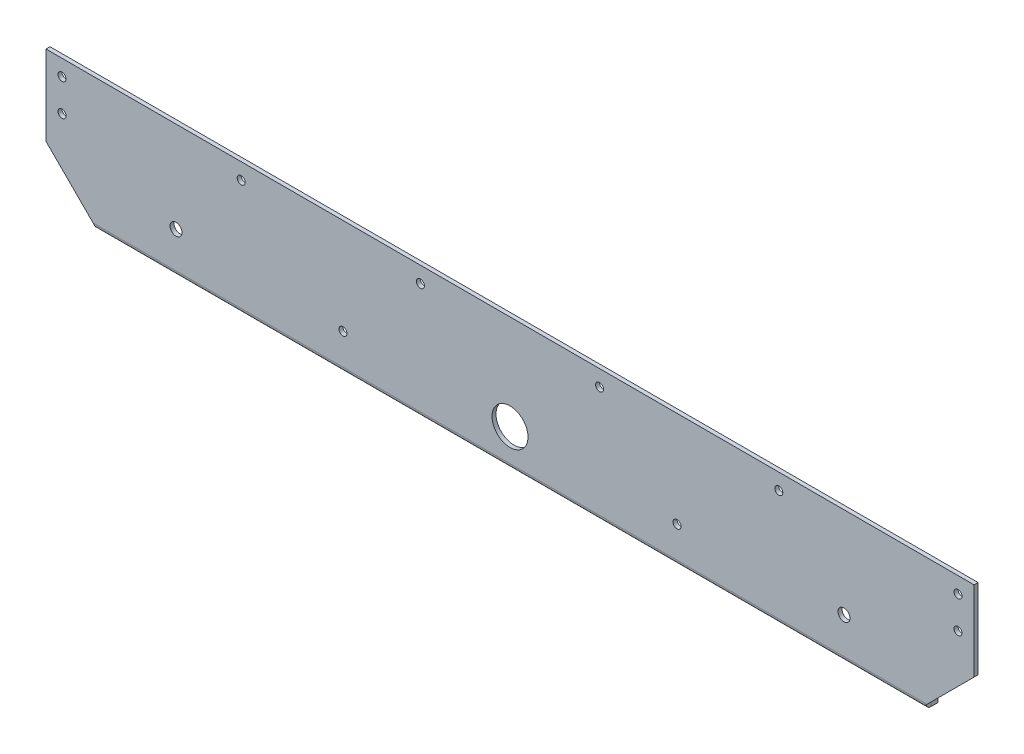
ISO-10303-21;
HEADER;
FILE_DESCRIPTION(('STEP AP214'),'2;1');
FILE_NAME('part.step','',(''),(''),'','','');
FILE_SCHEMA(('AUTOMOTIVE_DESIGN { 1 0 10303 214 1 1 1 1 }'));
ENDSEC;
DATA;
#1=APPLICATION_CONTEXT('core data for automotive mechanical design processes');
#2=APPLICATION_PROTOCOL_DEFINITION('international standard','automotive_design',2000,#1);
#3=PRODUCT_CONTEXT('',#1,'mechanical');
#4=PRODUCT('Part','Part','',(#3));
#5=PRODUCT_RELATED_PRODUCT_CATEGORY('part','',(#4));
#6=PRODUCT_DEFINITION_FORMATION('','',#4);
#7=PRODUCT_DEFINITION_CONTEXT('part definition',#1,'design');
#8=PRODUCT_DEFINITION('design','',#6,#7);
#9=PRODUCT_DEFINITION_SHAPE('','',#8);
#10=(LENGTH_UNIT() NAMED_UNIT(*) SI_UNIT(.MILLI.,.METRE.));
#11=(NAMED_UNIT(*) PLANE_ANGLE_UNIT() SI_UNIT($,.RADIAN.));
#12=(NAMED_UNIT(*) SI_UNIT($,.STERADIAN.) SOLID_ANGLE_UNIT());
#13=UNCERTAINTY_MEASURE_WITH_UNIT(LENGTH_MEASURE(1.E-05),#10,'distance_accuracy_value','');
#14=(GEOMETRIC_REPRESENTATION_CONTEXT(3) GLOBAL_UNCERTAINTY_ASSIGNED_CONTEXT((#13)) GLOBAL_UNIT_ASSIGNED_CONTEXT((#10,
#11,#12)) REPRESENTATION_CONTEXT('',''));
#15=CARTESIAN_POINT('',(0.,0.,0.));
#16=DIRECTION('',(0.,0.,1.));
#17=DIRECTION('',(1.,0.,0.));
#18=AXIS2_PLACEMENT_3D('',#15,#16,#17);
#19=CARTESIAN_POINT('',(-330.2,-50.8,-3.175));
#20=DIRECTION('',(1.,0.,0.));
#21=DIRECTION('',(0.,1.,0.));
#22=AXIS2_PLACEMENT_3D('',#19,#20,#21);
#23=PLANE('',#22);
#24=DIRECTION('',(0.,0.,1.));
#25=VECTOR('',#24,1.);
#26=CARTESIAN_POINT('',(-330.2,-50.8,-3.175));
#27=LINE('',#26,#25);
#28=CARTESIAN_POINT('',(-330.2,-50.8,-0.0699812005874288));
#29=VERTEX_POINT('',#28);
#30=CARTESIAN_POINT('',(-330.2,-50.8,0.));
#31=VERTEX_POINT('',#30);
#32=EDGE_CURVE('E54',#29,#31,#27,.T.);
#33=ORIENTED_EDGE('',*,*,#32,.F.);
#34=CARTESIAN_POINT('',(-330.2,-50.0634,-3.91159999999999));
#35=DIRECTION('',(-1.,0.,0.));
#36=DIRECTION('',(0.,0.,1.));
#37=AXIS2_PLACEMENT_3D('',#34,#35,#36);
#38=CIRCLE('',#37,3.9116);
#39=CARTESIAN_POINT('',(-330.2,-50.0634,0.));
#40=VERTEX_POINT('',#39);
#41=EDGE_CURVE('E11',#29,#40,#38,.T.);
#42=ORIENTED_EDGE('',*,*,#41,.T.);
#43=DIRECTION('',(0.,1.,0.));
#44=VECTOR('',#43,1.);
#45=CARTESIAN_POINT('',(-330.200000000004,-2.48843091726332E-11,0.));
#46=LINE('',#45,#44);
#47=EDGE_CURVE('E203',#31,#40,#46,.T.);
#48=ORIENTED_EDGE('',*,*,#47,.F.);
#49=EDGE_LOOP('',(#33,#42,#48));
#50=FACE_BOUND('',#49,.T.);
#51=ADVANCED_FACE('F37',(#50),#23,.T.);
#52=CARTESIAN_POINT('',(330.199999999999,-50.0634,-3.17499999999999));
#53=DIRECTION('',(-1.,-5.27529267742067E-13,0.));
#54=DIRECTION('',(5.27529267742067E-13,-1.,0.));
#55=AXIS2_PLACEMENT_3D('',#52,#53,#54);
#56=PLANE('',#55);
#57=DIRECTION('',(5.27529267742067E-13,-1.,0.));
#58=VECTOR('',#57,1.);
#59=CARTESIAN_POINT('',(330.199999999973,1.74190164208416E-10,0.));
#60=LINE('',#59,#58);
#61=CARTESIAN_POINT('',(330.199999999999,-50.0634,0.));
#62=VERTEX_POINT('',#61);
#63=CARTESIAN_POINT('',(330.2,-50.8,0.));
#64=VERTEX_POINT('',#63);
#65=EDGE_CURVE('E198',#62,#64,#60,.T.);
#66=ORIENTED_EDGE('',*,*,#65,.F.);
#67=CARTESIAN_POINT('',(330.199999999999,-50.0634,-3.91159999999999));
#68=DIRECTION('',(-1.,0.,0.));
#69=DIRECTION('',(0.,0.,1.));
#70=AXIS2_PLACEMENT_3D('',#67,#68,#69);
#71=CIRCLE('',#70,3.9116);
#72=CARTESIAN_POINT('',(330.199999999999,-50.8,-0.0699812005874288));
#73=VERTEX_POINT('',#72);
#74=EDGE_CURVE('E188',#62,#73,#71,.F.);
#75=ORIENTED_EDGE('',*,*,#74,.T.);
#76=DIRECTION('',(0.,0.,1.));
#77=VECTOR('',#76,1.);
#78=CARTESIAN_POINT('',(330.2,-50.8,-3.175));
#79=LINE('',#78,#77);
#80=EDGE_CURVE('E217',#73,#64,#79,.T.);
#81=ORIENTED_EDGE('',*,*,#80,.T.);
#82=EDGE_LOOP('',(#66,#75,#81));
#83=FACE_BOUND('',#82,.T.);
#84=ADVANCED_FACE('F269',(#83),#56,.T.);
#85=CARTESIAN_POINT('',(0.,0.,-3.175));
#86=DIRECTION('',(0.,0.,1.));
#87=DIRECTION('',(1.,0.,0.));
#88=AXIS2_PLACEMENT_3D('',#85,#86,#87);
#89=PLANE('',#88);
#90=CARTESIAN_POINT('',(132.584083532934,-25.4000000000025,-3.175));
#91=DIRECTION('',(0.,0.,1.));
#92=DIRECTION('',(1.,0.,0.));
#93=AXIS2_PLACEMENT_3D('',#90,#91,#92);
#94=CIRCLE('',#93,3.175);
#95=CARTESIAN_POINT('',(135.759083532934,-25.4000000000025,-3.175));
#96=VERTEX_POINT('',#95);
#97=EDGE_CURVE('E618',#96,#96,#94,.T.);
#98=ORIENTED_EDGE('',*,*,#97,.T.);
#99=EDGE_LOOP('',(#98));
#100=FACE_BOUND('',#99,.T.);
#101=CARTESIAN_POINT('',(-132.584083532934,-25.4,-3.175));
#102=DIRECTION('',(0.,0.,1.));
#103=DIRECTION('',(1.,0.,0.));
#104=AXIS2_PLACEMENT_3D('',#101,#102,#103);
#105=CIRCLE('',#104,3.175);
#106=CARTESIAN_POINT('',(-129.409083532934,-25.4,-3.175));
#107=VERTEX_POINT('',#106);
#108=EDGE_CURVE('E622',#107,#107,#105,.T.);
#109=ORIENTED_EDGE('',*,*,#108,.T.);
#110=EDGE_LOOP('',(#109));
#111=FACE_BOUND('',#110,.T.);
#112=CARTESIAN_POINT('',(213.36,38.1000000000001,-3.175));
#113=DIRECTION('',(0.,0.,1.));
#114=DIRECTION('',(1.,0.,0.));
#115=AXIS2_PLACEMENT_3D('',#112,#113,#114);
#116=CIRCLE('',#115,3.175);
#117=CARTESIAN_POINT('',(216.535,38.1000000000001,-3.175));
#118=VERTEX_POINT('',#117);
#119=EDGE_CURVE('E631',#118,#118,#116,.T.);
#120=ORIENTED_EDGE('',*,*,#119,.T.);
#121=EDGE_LOOP('',(#120));
#122=FACE_BOUND('',#121,.T.);
#123=CARTESIAN_POINT('',(71.12,38.1000000000001,-3.175));
#124=DIRECTION('',(0.,0.,1.));
#125=DIRECTION('',(1.,0.,0.));
#126=AXIS2_PLACEMENT_3D('',#123,#124,#125);
#127=CIRCLE('',#126,3.175);
#128=CARTESIAN_POINT('',(74.295,38.1000000000001,-3.175));
#129=VERTEX_POINT('',#128);
#130=EDGE_CURVE('E637',#129,#129,#127,.T.);
#131=ORIENTED_EDGE('',*,*,#130,.T.);
#132=EDGE_LOOP('',(#131));
#133=FACE_BOUND('',#132,.T.);
#134=CARTESIAN_POINT('',(-71.12,38.1000000000001,-3.175));
#135=DIRECTION('',(0.,0.,1.));
#136=DIRECTION('',(1.,0.,0.));
#137=AXIS2_PLACEMENT_3D('',#134,#135,#136);
#138=CIRCLE('',#137,3.175);
#139=CARTESIAN_POINT('',(-67.945,38.1000000000001,-3.175));
#140=VERTEX_POINT('',#139);
#141=EDGE_CURVE('E643',#140,#140,#138,.T.);
#142=ORIENTED_EDGE('',*,*,#141,.T.);
#143=EDGE_LOOP('',(#142));
#144=FACE_BOUND('',#143,.T.);
#145=CARTESIAN_POINT('',(-213.36,38.1000000000001,-3.175));
#146=DIRECTION('',(0.,0.,1.));
#147=DIRECTION('',(1.,0.,0.));
#148=AXIS2_PLACEMENT_3D('',#145,#146,#147);
#149=CIRCLE('',#148,3.175);
#150=CARTESIAN_POINT('',(-210.185,38.1000000000001,-3.175));
#151=VERTEX_POINT('',#150);
#152=EDGE_CURVE('E649',#151,#151,#149,.T.);
#153=ORIENTED_EDGE('',*,*,#152,.T.);
#154=EDGE_LOOP('',(#153));
#155=FACE_BOUND('',#154,.T.);
#156=CARTESIAN_POINT('',(-355.6,38.1,-3.175));
#157=DIRECTION('',(0.,0.,1.));
#158=DIRECTION('',(1.,0.,0.));
#159=AXIS2_PLACEMENT_3D('',#156,#157,#158);
#160=CIRCLE('',#159,3.17499999999997);
#161=CARTESIAN_POINT('',(-352.425,38.1,-3.175));
#162=VERTEX_POINT('',#161);
#163=EDGE_CURVE('E655',#162,#162,#160,.T.);
#164=ORIENTED_EDGE('',*,*,#163,.T.);
#165=EDGE_LOOP('',(#164));
#166=FACE_BOUND('',#165,.T.);
#167=CARTESIAN_POINT('',(-355.6,12.7,-3.175));
#168=DIRECTION('',(0.,0.,1.));
#169=DIRECTION('',(1.,0.,0.));
#170=AXIS2_PLACEMENT_3D('',#167,#168,#169);
#171=CIRCLE('',#170,3.17499999999997);
#172=CARTESIAN_POINT('',(-352.425,12.7,-3.175));
#173=VERTEX_POINT('',#172);
#174=EDGE_CURVE('E661',#173,#173,#171,.T.);
#175=ORIENTED_EDGE('',*,*,#174,.T.);
#176=EDGE_LOOP('',(#175));
#177=FACE_BOUND('',#176,.T.);
#178=CARTESIAN_POINT('',(355.6,12.7000000000001,-3.175));
#179=DIRECTION('',(0.,0.,1.));
#180=DIRECTION('',(1.,0.,0.));
#181=AXIS2_PLACEMENT_3D('',#178,#179,#180);
#182=CIRCLE('',#181,3.17499999999997);
#183=CARTESIAN_POINT('',(358.775,12.7000000000001,-3.175));
#184=VERTEX_POINT('',#183);
#185=EDGE_CURVE('E667',#184,#184,#182,.T.);
#186=ORIENTED_EDGE('',*,*,#185,.T.);
#187=EDGE_LOOP('',(#186));
#188=FACE_BOUND('',#187,.T.);
#189=CARTESIAN_POINT('',(355.6,38.1000000000001,-3.175));
#190=DIRECTION('',(0.,0.,1.));
#191=DIRECTION('',(1.,0.,0.));
#192=AXIS2_PLACEMENT_3D('',#189,#190,#191);
#193=CIRCLE('',#192,3.17499999999997);
#194=CARTESIAN_POINT('',(358.775,38.1000000000001,-3.175));
#195=VERTEX_POINT('',#194);
#196=EDGE_CURVE('E673',#195,#195,#193,.T.);
#197=ORIENTED_EDGE('',*,*,#196,.T.);
#198=EDGE_LOOP('',(#197));
#199=FACE_BOUND('',#198,.T.);
#200=CARTESIAN_POINT('',(265.1125,-21.4884,-3.175));
#201=DIRECTION('',(0.,0.,1.));
#202=DIRECTION('',(1.,0.,0.));
#203=AXIS2_PLACEMENT_3D('',#200,#201,#202);
#204=CIRCLE('',#203,4.76250000000001);
#205=CARTESIAN_POINT('',(269.875,-21.4884,-3.175));
#206=VERTEX_POINT('',#205);
#207=EDGE_CURVE('E679',#206,#206,#204,.T.);
#208=ORIENTED_EDGE('',*,*,#207,.T.);
#209=EDGE_LOOP('',(#208));
#210=FACE_BOUND('',#209,.T.);
#211=CARTESIAN_POINT('',(-265.1125,-21.4884,-3.175));
#212=DIRECTION('',(0.,0.,1.));
#213=DIRECTION('',(1.,0.,0.));
#214=AXIS2_PLACEMENT_3D('',#211,#212,#213);
#215=CIRCLE('',#214,4.76250000000001);
#216=CARTESIAN_POINT('',(-260.35,-21.4884,-3.175));
#217=VERTEX_POINT('',#216);
#218=EDGE_CURVE('E685',#217,#217,#215,.T.);
#219=ORIENTED_EDGE('',*,*,#218,.T.);
#220=EDGE_LOOP('',(#219));
#221=FACE_BOUND('',#220,.T.);
#222=CARTESIAN_POINT('',(0.,-24.6634,-3.175));
#223=DIRECTION('',(0.,0.,1.));
#224=DIRECTION('',(1.,0.,0.));
#225=AXIS2_PLACEMENT_3D('',#222,#223,#224);
#226=CIRCLE('',#225,14.2875);
#227=CARTESIAN_POINT('',(14.2875,-24.6634,-3.175));
#228=VERTEX_POINT('',#227);
#229=EDGE_CURVE('E691',#228,#228,#226,.T.);
#230=ORIENTED_EDGE('',*,*,#229,.T.);
#231=EDGE_LOOP('',(#230));
#232=FACE_BOUND('',#231,.T.);
#233=DIRECTION('',(0.,1.,0.));
#234=VECTOR('',#233,1.);
#235=CARTESIAN_POINT('',(-330.2,-50.8,-3.175));
#236=LINE('',#235,#234);
#237=CARTESIAN_POINT('',(-330.2,-50.8,-3.175));
#238=VERTEX_POINT('',#237);
#239=CARTESIAN_POINT('',(-330.2,-50.0634,-3.175));
#240=VERTEX_POINT('',#239);
#241=EDGE_CURVE('E196',#238,#240,#236,.T.);
#242=ORIENTED_EDGE('',*,*,#241,.F.);
#243=DIRECTION('',(-0.707106781186548,0.707106781186547,0.));
#244=VECTOR('',#243,1.);
#245=CARTESIAN_POINT('',(-330.2,-50.8,-3.175));
#246=LINE('',#245,#244);
#247=CARTESIAN_POINT('',(-368.3,-12.7,-3.175));
#248=VERTEX_POINT('',#247);
#249=EDGE_CURVE('E219',#238,#248,#246,.T.);
#250=ORIENTED_EDGE('',*,*,#249,.T.);
#251=DIRECTION('',(0.,-1.,0.));
#252=VECTOR('',#251,1.);
#253=CARTESIAN_POINT('',(-368.3,50.8,-3.175));
#254=LINE('',#253,#252);
#255=CARTESIAN_POINT('',(-368.3,50.8,-3.175));
#256=VERTEX_POINT('',#255);
#257=EDGE_CURVE('E235',#256,#248,#254,.T.);
#258=ORIENTED_EDGE('',*,*,#257,.F.);
#259=DIRECTION('',(-1.,0.,0.));
#260=VECTOR('',#259,1.);
#261=CARTESIAN_POINT('',(-368.3,50.8,-3.175));
#262=LINE('',#261,#260);
#263=CARTESIAN_POINT('',(368.3,50.8,-3.175));
#264=VERTEX_POINT('',#263);
#265=EDGE_CURVE('E231',#264,#256,#262,.T.);
#266=ORIENTED_EDGE('',*,*,#265,.F.);
#267=DIRECTION('',(0.,1.,0.));
#268=VECTOR('',#267,1.);
#269=CARTESIAN_POINT('',(368.3,50.8,-3.175));
#270=LINE('',#269,#268);
#271=CARTESIAN_POINT('',(368.3,-12.7,-3.175));
#272=VERTEX_POINT('',#271);
#273=EDGE_CURVE('E229',#272,#264,#270,.T.);
#274=ORIENTED_EDGE('',*,*,#273,.F.);
#275=DIRECTION('',(-0.707106781186548,-0.707106781186547,0.));
#276=VECTOR('',#275,1.);
#277=CARTESIAN_POINT('',(330.2,-50.8,-3.175));
#278=LINE('',#277,#276);
#279=CARTESIAN_POINT('',(330.2,-50.8,-3.175));
#280=VERTEX_POINT('',#279);
#281=EDGE_CURVE('E207',#272,#280,#278,.T.);
#282=ORIENTED_EDGE('',*,*,#281,.T.);
#283=DIRECTION('',(5.27529267742067E-13,-1.,0.));
#284=VECTOR('',#283,1.);
#285=CARTESIAN_POINT('',(330.199999999999,-50.0634,-3.17499999999999));
#286=LINE('',#285,#284);
#287=CARTESIAN_POINT('',(330.199999999999,-50.0634,-3.175));
#288=VERTEX_POINT('',#287);
#289=EDGE_CURVE('E190',#288,#280,#286,.T.);
#290=ORIENTED_EDGE('',*,*,#289,.F.);
#291=DIRECTION('',(-1.,0.,0.));
#292=VECTOR('',#291,1.);
#293=CARTESIAN_POINT('',(-330.2,-50.0634,-3.17499999999999));
#294=LINE('',#293,#292);
#295=EDGE_CURVE('E62',#240,#288,#294,.F.);
#296=ORIENTED_EDGE('',*,*,#295,.F.);
#297=EDGE_LOOP('',(#242,#250,#258,#266,#274,#282,#290,#296));
#298=FACE_BOUND('',#297,.T.);
#299=ADVANCED_FACE('F261',(#100,#111,#122,#133,#144,#155,#166,#177,#188,#199,#210,#221,#232,
#298),#89,.F.);
#300=CARTESIAN_POINT('',(0.,0.,0.));
#301=DIRECTION('',(0.,0.,1.));
#302=DIRECTION('',(1.,0.,0.));
#303=AXIS2_PLACEMENT_3D('',#300,#301,#302);
#304=PLANE('',#303);
#305=CARTESIAN_POINT('',(132.584083532934,-25.4000000000025,0.));
#306=DIRECTION('',(0.,0.,1.));
#307=DIRECTION('',(1.,0.,0.));
#308=AXIS2_PLACEMENT_3D('',#305,#306,#307);
#309=CIRCLE('',#308,3.175);
#310=CARTESIAN_POINT('',(135.759083532934,-25.4000000000025,0.));
#311=VERTEX_POINT('',#310);
#312=EDGE_CURVE('E615',#311,#311,#309,.T.);
#313=ORIENTED_EDGE('',*,*,#312,.F.);
#314=EDGE_LOOP('',(#313));
#315=FACE_BOUND('',#314,.T.);
#316=CARTESIAN_POINT('',(-132.584083532934,-25.4,0.));
#317=DIRECTION('',(0.,0.,1.));
#318=DIRECTION('',(1.,0.,0.));
#319=AXIS2_PLACEMENT_3D('',#316,#317,#318);
#320=CIRCLE('',#319,3.175);
#321=CARTESIAN_POINT('',(-129.409083532934,-25.4,0.));
#322=VERTEX_POINT('',#321);
#323=EDGE_CURVE('E619',#322,#322,#320,.T.);
#324=ORIENTED_EDGE('',*,*,#323,.F.);
#325=EDGE_LOOP('',(#324));
#326=FACE_BOUND('',#325,.T.);
#327=CARTESIAN_POINT('',(213.36,38.1000000000001,0.));
#328=DIRECTION('',(0.,0.,1.));
#329=DIRECTION('',(1.,0.,0.));
#330=AXIS2_PLACEMENT_3D('',#327,#328,#329);
#331=CIRCLE('',#330,3.175);
#332=CARTESIAN_POINT('',(216.535,38.1000000000001,0.));
#333=VERTEX_POINT('',#332);
#334=EDGE_CURVE('E628',#333,#333,#331,.T.);
#335=ORIENTED_EDGE('',*,*,#334,.F.);
#336=EDGE_LOOP('',(#335));
#337=FACE_BOUND('',#336,.T.);
#338=CARTESIAN_POINT('',(71.12,38.1000000000001,0.));
#339=DIRECTION('',(0.,0.,1.));
#340=DIRECTION('',(1.,0.,0.));
#341=AXIS2_PLACEMENT_3D('',#338,#339,#340);
#342=CIRCLE('',#341,3.175);
#343=CARTESIAN_POINT('',(74.295,38.1000000000001,0.));
#344=VERTEX_POINT('',#343);
#345=EDGE_CURVE('E634',#344,#344,#342,.T.);
#346=ORIENTED_EDGE('',*,*,#345,.F.);
#347=EDGE_LOOP('',(#346));
#348=FACE_BOUND('',#347,.T.);
#349=CARTESIAN_POINT('',(-71.12,38.1000000000001,0.));
#350=DIRECTION('',(0.,0.,1.));
#351=DIRECTION('',(1.,0.,0.));
#352=AXIS2_PLACEMENT_3D('',#349,#350,#351);
#353=CIRCLE('',#352,3.175);
#354=CARTESIAN_POINT('',(-67.945,38.1000000000001,0.));
#355=VERTEX_POINT('',#354);
#356=EDGE_CURVE('E640',#355,#355,#353,.T.);
#357=ORIENTED_EDGE('',*,*,#356,.F.);
#358=EDGE_LOOP('',(#357));
#359=FACE_BOUND('',#358,.T.);
#360=CARTESIAN_POINT('',(-213.36,38.1000000000001,0.));
#361=DIRECTION('',(0.,0.,1.));
#362=DIRECTION('',(1.,0.,0.));
#363=AXIS2_PLACEMENT_3D('',#360,#361,#362);
#364=CIRCLE('',#363,3.175);
#365=CARTESIAN_POINT('',(-210.185,38.1000000000001,0.));
#366=VERTEX_POINT('',#365);
#367=EDGE_CURVE('E646',#366,#366,#364,.T.);
#368=ORIENTED_EDGE('',*,*,#367,.F.);
#369=EDGE_LOOP('',(#368));
#370=FACE_BOUND('',#369,.T.);
#371=CARTESIAN_POINT('',(-355.6,38.1,0.));
#372=DIRECTION('',(0.,0.,1.));
#373=DIRECTION('',(-1.,0.,0.));
#374=AXIS2_PLACEMENT_3D('',#371,#372,#373);
#375=CIRCLE('',#374,3.17499999999997);
#376=CARTESIAN_POINT('',(-358.775,38.1,0.));
#377=VERTEX_POINT('',#376);
#378=EDGE_CURVE('E652',#377,#377,#375,.T.);
#379=ORIENTED_EDGE('',*,*,#378,.F.);
#380=EDGE_LOOP('',(#379));
#381=FACE_BOUND('',#380,.T.);
#382=CARTESIAN_POINT('',(-355.6,12.7,0.));
#383=DIRECTION('',(0.,0.,1.));
#384=DIRECTION('',(-1.,0.,0.));
#385=AXIS2_PLACEMENT_3D('',#382,#383,#384);
#386=CIRCLE('',#385,3.17499999999997);
#387=CARTESIAN_POINT('',(-358.775,12.7,0.));
#388=VERTEX_POINT('',#387);
#389=EDGE_CURVE('E658',#388,#388,#386,.T.);
#390=ORIENTED_EDGE('',*,*,#389,.F.);
#391=EDGE_LOOP('',(#390));
#392=FACE_BOUND('',#391,.T.);
#393=CARTESIAN_POINT('',(355.6,12.7000000000001,0.));
#394=DIRECTION('',(0.,0.,1.));
#395=DIRECTION('',(1.,0.,0.));
#396=AXIS2_PLACEMENT_3D('',#393,#394,#395);
#397=CIRCLE('',#396,3.17499999999997);
#398=CARTESIAN_POINT('',(358.775,12.7000000000001,0.));
#399=VERTEX_POINT('',#398);
#400=EDGE_CURVE('E664',#399,#399,#397,.T.);
#401=ORIENTED_EDGE('',*,*,#400,.F.);
#402=EDGE_LOOP('',(#401));
#403=FACE_BOUND('',#402,.T.);
#404=CARTESIAN_POINT('',(355.6,38.1000000000001,0.));
#405=DIRECTION('',(0.,0.,1.));
#406=DIRECTION('',(1.,0.,0.));
#407=AXIS2_PLACEMENT_3D('',#404,#405,#406);
#408=CIRCLE('',#407,3.17499999999997);
#409=CARTESIAN_POINT('',(358.775,38.1000000000001,0.));
#410=VERTEX_POINT('',#409);
#411=EDGE_CURVE('E670',#410,#410,#408,.T.);
#412=ORIENTED_EDGE('',*,*,#411,.F.);
#413=EDGE_LOOP('',(#412));
#414=FACE_BOUND('',#413,.T.);
#415=CARTESIAN_POINT('',(265.1125,-21.4884,0.));
#416=DIRECTION('',(0.,0.,1.));
#417=DIRECTION('',(1.,0.,0.));
#418=AXIS2_PLACEMENT_3D('',#415,#416,#417);
#419=CIRCLE('',#418,4.76250000000001);
#420=CARTESIAN_POINT('',(269.875,-21.4884,0.));
#421=VERTEX_POINT('',#420);
#422=EDGE_CURVE('E676',#421,#421,#419,.T.);
#423=ORIENTED_EDGE('',*,*,#422,.F.);
#424=EDGE_LOOP('',(#423));
#425=FACE_BOUND('',#424,.T.);
#426=CARTESIAN_POINT('',(-265.1125,-21.4884,0.));
#427=DIRECTION('',(0.,0.,1.));
#428=DIRECTION('',(1.,0.,0.));
#429=AXIS2_PLACEMENT_3D('',#426,#427,#428);
#430=CIRCLE('',#429,4.76250000000001);
#431=CARTESIAN_POINT('',(-260.35,-21.4884,0.));
#432=VERTEX_POINT('',#431);
#433=EDGE_CURVE('E682',#432,#432,#430,.T.);
#434=ORIENTED_EDGE('',*,*,#433,.F.);
#435=EDGE_LOOP('',(#434));
#436=FACE_BOUND('',#435,.T.);
#437=CARTESIAN_POINT('',(0.,-24.6634,0.));
#438=DIRECTION('',(0.,0.,1.));
#439=DIRECTION('',(1.,0.,0.));
#440=AXIS2_PLACEMENT_3D('',#437,#438,#439);
#441=CIRCLE('',#440,14.2875);
#442=CARTESIAN_POINT('',(14.2875,-24.6634,0.));
#443=VERTEX_POINT('',#442);
#444=EDGE_CURVE('E688',#443,#443,#441,.T.);
#445=ORIENTED_EDGE('',*,*,#444,.F.);
#446=EDGE_LOOP('',(#445));
#447=FACE_BOUND('',#446,.T.);
#448=DIRECTION('',(-0.707106781186548,0.707106781186547,0.));
#449=VECTOR('',#448,1.);
#450=CARTESIAN_POINT('',(-330.2,-50.8,0.));
#451=LINE('',#450,#449);
#452=CARTESIAN_POINT('',(-368.3,-12.7,0.));
#453=VERTEX_POINT('',#452);
#454=EDGE_CURVE('E216',#31,#453,#451,.T.);
#455=ORIENTED_EDGE('',*,*,#454,.F.);
#456=ORIENTED_EDGE('',*,*,#47,.T.);
#457=DIRECTION('',(-1.,0.,0.));
#458=VECTOR('',#457,1.);
#459=CARTESIAN_POINT('',(-330.2,-50.0634,0.));
#460=LINE('',#459,#458);
#461=EDGE_CURVE('E144',#40,#62,#460,.F.);
#462=ORIENTED_EDGE('',*,*,#461,.T.);
#463=ORIENTED_EDGE('',*,*,#65,.T.);
#464=DIRECTION('',(-0.707106781186548,-0.707106781186547,0.));
#465=VECTOR('',#464,1.);
#466=CARTESIAN_POINT('',(330.2,-50.8,0.));
#467=LINE('',#466,#465);
#468=CARTESIAN_POINT('',(368.3,-12.7,0.));
#469=VERTEX_POINT('',#468);
#470=EDGE_CURVE('E206',#469,#64,#467,.T.);
#471=ORIENTED_EDGE('',*,*,#470,.F.);
#472=DIRECTION('',(0.,1.,0.));
#473=VECTOR('',#472,1.);
#474=CARTESIAN_POINT('',(368.3,50.8,0.));
#475=LINE('',#474,#473);
#476=CARTESIAN_POINT('',(368.3,50.8,0.));
#477=VERTEX_POINT('',#476);
#478=EDGE_CURVE('E226',#469,#477,#475,.T.);
#479=ORIENTED_EDGE('',*,*,#478,.T.);
#480=DIRECTION('',(-1.,0.,0.));
#481=VECTOR('',#480,1.);
#482=CARTESIAN_POINT('',(-368.3,50.8,0.));
#483=LINE('',#482,#481);
#484=CARTESIAN_POINT('',(-368.3,50.8,0.));
#485=VERTEX_POINT('',#484);
#486=EDGE_CURVE('E239',#477,#485,#483,.T.);
#487=ORIENTED_EDGE('',*,*,#486,.T.);
#488=DIRECTION('',(0.,-1.,0.));
#489=VECTOR('',#488,1.);
#490=CARTESIAN_POINT('',(-368.3,50.8,0.));
#491=LINE('',#490,#489);
#492=EDGE_CURVE('E232',#485,#453,#491,.T.);
#493=ORIENTED_EDGE('',*,*,#492,.T.);
#494=EDGE_LOOP('',(#455,#456,#462,#463,#471,#479,#487,#493));
#495=FACE_BOUND('',#494,.T.);
#496=ADVANCED_FACE('F256',(#315,#326,#337,#348,#359,#370,#381,#392,#403,#414,#425,#436,#447,
#495),#304,.T.);
#497=CARTESIAN_POINT('',(368.3,50.8,-3.175));
#498=DIRECTION('',(1.,0.,0.));
#499=DIRECTION('',(0.,0.,-1.));
#500=AXIS2_PLACEMENT_3D('',#497,#498,#499);
#501=PLANE('',#500);
#502=DIRECTION('',(0.,0.,1.));
#503=VECTOR('',#502,1.);
#504=CARTESIAN_POINT('',(368.3,-12.7,-3.175));
#505=LINE('',#504,#503);
#506=EDGE_CURVE('E210',#272,#469,#505,.T.);
#507=ORIENTED_EDGE('',*,*,#506,.F.);
#508=ORIENTED_EDGE('',*,*,#273,.T.);
#509=DIRECTION('',(0.,0.,1.));
#510=VECTOR('',#509,1.);
#511=CARTESIAN_POINT('',(368.3,50.8,-3.175));
#512=LINE('',#511,#510);
#513=EDGE_CURVE('E41',#264,#477,#512,.T.);
#514=ORIENTED_EDGE('',*,*,#513,.T.);
#515=ORIENTED_EDGE('',*,*,#478,.F.);
#516=EDGE_LOOP('',(#507,#508,#514,#515));
#517=FACE_BOUND('',#516,.T.);
#518=ADVANCED_FACE('F39',(#517),#501,.T.);
#519=CARTESIAN_POINT('',(-368.3,50.8,-3.175));
#520=DIRECTION('',(-1.,0.,0.));
#521=DIRECTION('',(0.,0.,1.));
#522=AXIS2_PLACEMENT_3D('',#519,#520,#521);
#523=PLANE('',#522);
#524=DIRECTION('',(0.,0.,1.));
#525=VECTOR('',#524,1.);
#526=CARTESIAN_POINT('',(-368.3,-12.7,-3.175));
#527=LINE('',#526,#525);
#528=EDGE_CURVE('E223',#248,#453,#527,.T.);
#529=ORIENTED_EDGE('',*,*,#528,.T.);
#530=ORIENTED_EDGE('',*,*,#492,.F.);
#531=DIRECTION('',(0.,0.,1.));
#532=VECTOR('',#531,1.);
#533=CARTESIAN_POINT('',(-368.3,50.8,-3.175));
#534=LINE('',#533,#532);
#535=EDGE_CURVE('E46',#256,#485,#534,.T.);
#536=ORIENTED_EDGE('',*,*,#535,.F.);
#537=ORIENTED_EDGE('',*,*,#257,.T.);
#538=EDGE_LOOP('',(#529,#530,#536,#537));
#539=FACE_BOUND('',#538,.T.);
#540=ADVANCED_FACE('F265',(#539),#523,.T.);
#541=CARTESIAN_POINT('',(-368.3,50.8,-3.175));
#542=DIRECTION('',(0.,1.,0.));
#543=DIRECTION('',(0.,0.,1.));
#544=AXIS2_PLACEMENT_3D('',#541,#542,#543);
#545=PLANE('',#544);
#546=ORIENTED_EDGE('',*,*,#486,.F.);
#547=ORIENTED_EDGE('',*,*,#513,.F.);
#548=ORIENTED_EDGE('',*,*,#265,.T.);
#549=ORIENTED_EDGE('',*,*,#535,.T.);
#550=EDGE_LOOP('',(#546,#547,#548,#549));
#551=FACE_BOUND('',#550,.T.);
#552=ADVANCED_FACE('F253',(#551),#545,.T.);
#553=CARTESIAN_POINT('',(-330.2,-50.8,-3.175));
#554=DIRECTION('',(0.707106781186547,0.707106781186548,0.));
#555=DIRECTION('',(-0.707106781186548,0.707106781186547,0.));
#556=AXIS2_PLACEMENT_3D('',#553,#554,#555);
#557=PLANE('',#556);
#558=ORIENTED_EDGE('',*,*,#454,.T.);
#559=ORIENTED_EDGE('',*,*,#528,.F.);
#560=ORIENTED_EDGE('',*,*,#249,.F.);
#561=EDGE_CURVE('E227',#238,#29,#27,.T.);
#562=ORIENTED_EDGE('',*,*,#561,.T.);
#563=ORIENTED_EDGE('',*,*,#32,.T.);
#564=EDGE_LOOP('',(#558,#559,#560,#562,#563));
#565=FACE_BOUND('',#564,.T.);
#566=ADVANCED_FACE('F267',(#565),#557,.F.);
#567=CARTESIAN_POINT('',(330.2,-50.8,-3.175));
#568=DIRECTION('',(-0.707106781186547,0.707106781186548,0.));
#569=DIRECTION('',(-0.707106781186548,-0.707106781186547,0.));
#570=AXIS2_PLACEMENT_3D('',#567,#568,#569);
#571=PLANE('',#570);
#572=ORIENTED_EDGE('',*,*,#470,.T.);
#573=ORIENTED_EDGE('',*,*,#80,.F.);
#574=EDGE_CURVE('E213',#280,#73,#79,.T.);
#575=ORIENTED_EDGE('',*,*,#574,.F.);
#576=ORIENTED_EDGE('',*,*,#281,.F.);
#577=ORIENTED_EDGE('',*,*,#506,.T.);
#578=EDGE_LOOP('',(#572,#573,#575,#576,#577));
#579=FACE_BOUND('',#578,.T.);
#580=ADVANCED_FACE('F260',(#579),#571,.F.);
#581=CARTESIAN_POINT('',(-330.2,-50.0634,-3.91159999999999));
#582=DIRECTION('',(1.,0.,0.));
#583=DIRECTION('',(0.,0.,-1.));
#584=AXIS2_PLACEMENT_3D('',#581,#582,#583);
#585=PLANE('',#584);
#586=ORIENTED_EDGE('',*,*,#561,.F.);
#587=ORIENTED_EDGE('',*,*,#241,.T.);
#588=CARTESIAN_POINT('',(-330.2,-50.0634,-3.91159999999999));
#589=DIRECTION('',(-1.,0.,0.));
#590=DIRECTION('',(0.,0.,1.));
#591=AXIS2_PLACEMENT_3D('',#588,#589,#590);
#592=CIRCLE('',#591,0.736599999999997);
#593=CARTESIAN_POINT('',(-330.2,-50.8,-3.91159999999998));
#594=VERTEX_POINT('',#593);
#595=EDGE_CURVE('E151',#594,#240,#592,.T.);
#596=ORIENTED_EDGE('',*,*,#595,.F.);
#597=DIRECTION('',(0.,-1.,0.));
#598=VECTOR('',#597,1.);
#599=CARTESIAN_POINT('',(-330.2,-50.8,-3.91159999999997));
#600=LINE('',#599,#598);
#601=CARTESIAN_POINT('',(-330.2,-53.975,-3.91159999999996));
#602=VERTEX_POINT('',#601);
#603=EDGE_CURVE('E148',#594,#602,#600,.T.);
#604=ORIENTED_EDGE('',*,*,#603,.T.);
#605=EDGE_CURVE('E48',#602,#29,#38,.T.);
#606=ORIENTED_EDGE('',*,*,#605,.T.);
#607=EDGE_LOOP('',(#586,#587,#596,#604,#606));
#608=FACE_BOUND('',#607,.T.);
#609=ADVANCED_FACE('F149',(#608),#585,.F.);
#610=CARTESIAN_POINT('',(330.2,-50.0634,-3.91159999999999));
#611=DIRECTION('',(1.,0.,0.));
#612=DIRECTION('',(0.,0.,-1.));
#613=AXIS2_PLACEMENT_3D('',#610,#611,#612);
#614=PLANE('',#613);
#615=CARTESIAN_POINT('',(330.2,-50.0634,-3.91159999999999));
#616=DIRECTION('',(-1.,0.,0.));
#617=DIRECTION('',(0.,0.,1.));
#618=AXIS2_PLACEMENT_3D('',#615,#616,#617);
#619=CIRCLE('',#618,0.736599999999997);
#620=CARTESIAN_POINT('',(330.199999999999,-50.8,-3.91159999999998));
#621=VERTEX_POINT('',#620);
#622=EDGE_CURVE('E145',#288,#621,#619,.F.);
#623=ORIENTED_EDGE('',*,*,#622,.F.);
#624=ORIENTED_EDGE('',*,*,#289,.T.);
#625=ORIENTED_EDGE('',*,*,#574,.T.);
#626=CARTESIAN_POINT('',(330.199999999999,-53.975,-3.91159999999997));
#627=VERTEX_POINT('',#626);
#628=EDGE_CURVE('E187',#73,#627,#71,.F.);
#629=ORIENTED_EDGE('',*,*,#628,.T.);
#630=DIRECTION('',(0.,-1.,0.));
#631=VECTOR('',#630,1.);
#632=CARTESIAN_POINT('',(330.2,-50.8,-3.91159999999999));
#633=LINE('',#632,#631);
#634=EDGE_CURVE('E694',#621,#627,#633,.T.);
#635=ORIENTED_EDGE('',*,*,#634,.F.);
#636=EDGE_LOOP('',(#623,#624,#625,#629,#635));
#637=FACE_BOUND('',#636,.T.);
#638=ADVANCED_FACE('F311',(#637),#614,.T.);
#639=CARTESIAN_POINT('',(-330.2,-50.0634,-3.91159999999999));
#640=DIRECTION('',(-1.,0.,0.));
#641=DIRECTION('',(0.,-1.,0.));
#642=AXIS2_PLACEMENT_3D('',#639,#640,#641);
#643=CYLINDRICAL_SURFACE('',#642,3.9116);
#644=ORIENTED_EDGE('',*,*,#461,.F.);
#645=ORIENTED_EDGE('',*,*,#41,.F.);
#646=ORIENTED_EDGE('',*,*,#605,.F.);
#647=DIRECTION('',(1.,0.,0.));
#648=VECTOR('',#647,1.);
#649=CARTESIAN_POINT('',(0.,-53.975,-3.91159999999997));
#650=LINE('',#649,#648);
#651=EDGE_CURVE('E140',#602,#627,#650,.T.);
#652=ORIENTED_EDGE('',*,*,#651,.T.);
#653=ORIENTED_EDGE('',*,*,#628,.F.);
#654=ORIENTED_EDGE('',*,*,#74,.F.);
#655=EDGE_LOOP('',(#644,#645,#646,#652,#653,#654));
#656=FACE_BOUND('',#655,.T.);
#657=ADVANCED_FACE('F137',(#656),#643,.T.);
#658=CARTESIAN_POINT('',(-330.2,-50.0634,-3.91159999999999));
#659=DIRECTION('',(-1.,0.,0.));
#660=DIRECTION('',(0.,-1.,0.));
#661=AXIS2_PLACEMENT_3D('',#658,#659,#660);
#662=CYLINDRICAL_SURFACE('',#661,0.736599999999997);
#663=ORIENTED_EDGE('',*,*,#295,.T.);
#664=ORIENTED_EDGE('',*,*,#622,.T.);
#665=DIRECTION('',(-1.,0.,0.));
#666=VECTOR('',#665,1.);
#667=CARTESIAN_POINT('',(330.2,-50.8,-3.91159999999999));
#668=LINE('',#667,#666);
#669=EDGE_CURVE('E155',#621,#594,#668,.T.);
#670=ORIENTED_EDGE('',*,*,#669,.T.);
#671=ORIENTED_EDGE('',*,*,#595,.T.);
#672=EDGE_LOOP('',(#663,#664,#670,#671));
#673=FACE_BOUND('',#672,.T.);
#674=ADVANCED_FACE('F324',(#673),#662,.F.);
#675=CARTESIAN_POINT('',(-330.2,-53.975,-9.52499999999999));
#676=DIRECTION('',(1.,0.,0.));
#677=DIRECTION('',(0.,0.,-1.));
#678=AXIS2_PLACEMENT_3D('',#675,#676,#677);
#679=PLANE('',#678);
#680=ORIENTED_EDGE('',*,*,#603,.F.);
#681=DIRECTION('',(0.,0.,-1.));
#682=VECTOR('',#681,1.);
#683=CARTESIAN_POINT('',(-330.2,-50.8,-9.525));
#684=LINE('',#683,#682);
#685=CARTESIAN_POINT('',(-330.2,-50.8,-9.525));
#686=VERTEX_POINT('',#685);
#687=EDGE_CURVE('E164',#594,#686,#684,.T.);
#688=ORIENTED_EDGE('',*,*,#687,.T.);
#689=DIRECTION('',(0.,1.,0.));
#690=VECTOR('',#689,1.);
#691=CARTESIAN_POINT('',(-330.2,-53.975,-9.52499999999999));
#692=LINE('',#691,#690);
#693=CARTESIAN_POINT('',(-330.2,-53.975,-9.52499999999999));
#694=VERTEX_POINT('',#693);
#695=EDGE_CURVE('E168',#694,#686,#692,.T.);
#696=ORIENTED_EDGE('',*,*,#695,.F.);
#697=DIRECTION('',(0.,0.,-1.));
#698=VECTOR('',#697,1.);
#699=CARTESIAN_POINT('',(-330.2,-53.975,-9.52499999999999));
#700=LINE('',#699,#698);
#701=EDGE_CURVE('E160',#602,#694,#700,.T.);
#702=ORIENTED_EDGE('',*,*,#701,.F.);
#703=EDGE_LOOP('',(#680,#688,#696,#702));
#704=FACE_BOUND('',#703,.T.);
#705=ADVANCED_FACE('F166',(#704),#679,.F.);
#706=CARTESIAN_POINT('',(330.2,-53.975,-3.17499999999999));
#707=DIRECTION('',(-1.,0.,0.));
#708=DIRECTION('',(0.,0.,1.));
#709=AXIS2_PLACEMENT_3D('',#706,#707,#708);
#710=PLANE('',#709);
#711=ORIENTED_EDGE('',*,*,#634,.T.);
#712=DIRECTION('',(0.,0.,1.));
#713=VECTOR('',#712,1.);
#714=CARTESIAN_POINT('',(330.2,-53.975,-3.17499999999999));
#715=LINE('',#714,#713);
#716=CARTESIAN_POINT('',(330.2,-53.975,-9.52499999999999));
#717=VERTEX_POINT('',#716);
#718=EDGE_CURVE('E163',#717,#627,#715,.T.);
#719=ORIENTED_EDGE('',*,*,#718,.F.);
#720=DIRECTION('',(0.,1.,0.));
#721=VECTOR('',#720,1.);
#722=CARTESIAN_POINT('',(330.2,-53.975,-9.52499999999999));
#723=LINE('',#722,#721);
#724=CARTESIAN_POINT('',(330.2,-50.8,-9.525));
#725=VERTEX_POINT('',#724);
#726=EDGE_CURVE('E180',#717,#725,#723,.T.);
#727=ORIENTED_EDGE('',*,*,#726,.T.);
#728=DIRECTION('',(0.,0.,1.));
#729=VECTOR('',#728,1.);
#730=CARTESIAN_POINT('',(330.2,-50.8,-3.175));
#731=LINE('',#730,#729);
#732=EDGE_CURVE('E171',#725,#621,#731,.T.);
#733=ORIENTED_EDGE('',*,*,#732,.T.);
#734=EDGE_LOOP('',(#711,#719,#727,#733));
#735=FACE_BOUND('',#734,.T.);
#736=ADVANCED_FACE('F338',(#735),#710,.F.);
#737=CARTESIAN_POINT('',(0.,-53.975,1.776189069446E-13));
#738=DIRECTION('',(0.,1.,0.));
#739=DIRECTION('',(0.,0.,1.));
#740=AXIS2_PLACEMENT_3D('',#737,#738,#739);
#741=PLANE('',#740);
#742=ORIENTED_EDGE('',*,*,#651,.F.);
#743=ORIENTED_EDGE('',*,*,#701,.T.);
#744=DIRECTION('',(1.,0.,0.));
#745=VECTOR('',#744,1.);
#746=CARTESIAN_POINT('',(330.2,-53.975,-9.52499999999999));
#747=LINE('',#746,#745);
#748=EDGE_CURVE('E170',#694,#717,#747,.T.);
#749=ORIENTED_EDGE('',*,*,#748,.T.);
#750=ORIENTED_EDGE('',*,*,#718,.T.);
#751=EDGE_LOOP('',(#742,#743,#749,#750));
#752=FACE_BOUND('',#751,.T.);
#753=ADVANCED_FACE('F159',(#752),#741,.F.);
#754=CARTESIAN_POINT('',(0.,-50.8,1.66533453693774E-13));
#755=DIRECTION('',(0.,1.,0.));
#756=DIRECTION('',(0.,0.,1.));
#757=AXIS2_PLACEMENT_3D('',#754,#755,#756);
#758=PLANE('',#757);
#759=ORIENTED_EDGE('',*,*,#687,.F.);
#760=ORIENTED_EDGE('',*,*,#669,.F.);
#761=ORIENTED_EDGE('',*,*,#732,.F.);
#762=DIRECTION('',(1.,0.,0.));
#763=VECTOR('',#762,1.);
#764=CARTESIAN_POINT('',(330.2,-50.8,-9.525));
#765=LINE('',#764,#763);
#766=EDGE_CURVE('E175',#686,#725,#765,.T.);
#767=ORIENTED_EDGE('',*,*,#766,.F.);
#768=EDGE_LOOP('',(#759,#760,#761,#767));
#769=FACE_BOUND('',#768,.T.);
#770=ADVANCED_FACE('F352',(#769),#758,.T.);
#771=CARTESIAN_POINT('',(330.2,-53.975,-9.52499999999999));
#772=DIRECTION('',(0.,0.,1.));
#773=DIRECTION('',(0.,-1.,0.));
#774=AXIS2_PLACEMENT_3D('',#771,#772,#773);
#775=PLANE('',#774);
#776=ORIENTED_EDGE('',*,*,#766,.T.);
#777=ORIENTED_EDGE('',*,*,#726,.F.);
#778=ORIENTED_EDGE('',*,*,#748,.F.);
#779=ORIENTED_EDGE('',*,*,#695,.T.);
#780=EDGE_LOOP('',(#776,#777,#778,#779));
#781=FACE_BOUND('',#780,.T.);
#782=ADVANCED_FACE('F359',(#781),#775,.F.);
#783=CARTESIAN_POINT('',(0.,-24.6634,-9.525));
#784=DIRECTION('',(0.,0.,1.));
#785=DIRECTION('',(1.,0.,0.));
#786=AXIS2_PLACEMENT_3D('',#783,#784,#785);
#787=CYLINDRICAL_SURFACE('',#786,14.2875);
#788=ORIENTED_EDGE('',*,*,#444,.T.);
#789=EDGE_LOOP('',(#788));
#790=FACE_BOUND('',#789,.T.);
#791=ORIENTED_EDGE('',*,*,#229,.F.);
#792=EDGE_LOOP('',(#791));
#793=FACE_BOUND('',#792,.T.);
#794=ADVANCED_FACE('F367',(#790,#793),#787,.F.);
#795=CARTESIAN_POINT('',(-265.1125,-21.4884,-9.525));
#796=DIRECTION('',(0.,0.,1.));
#797=DIRECTION('',(1.,0.,0.));
#798=AXIS2_PLACEMENT_3D('',#795,#796,#797);
#799=CYLINDRICAL_SURFACE('',#798,4.76250000000001);
#800=ORIENTED_EDGE('',*,*,#433,.T.);
#801=EDGE_LOOP('',(#800));
#802=FACE_BOUND('',#801,.T.);
#803=ORIENTED_EDGE('',*,*,#218,.F.);
#804=EDGE_LOOP('',(#803));
#805=FACE_BOUND('',#804,.T.);
#806=ADVANCED_FACE('F375',(#802,#805),#799,.F.);
#807=CARTESIAN_POINT('',(265.1125,-21.4884,-9.525));
#808=DIRECTION('',(0.,0.,1.));
#809=DIRECTION('',(1.,0.,0.));
#810=AXIS2_PLACEMENT_3D('',#807,#808,#809);
#811=CYLINDRICAL_SURFACE('',#810,4.76250000000001);
#812=ORIENTED_EDGE('',*,*,#422,.T.);
#813=EDGE_LOOP('',(#812));
#814=FACE_BOUND('',#813,.T.);
#815=ORIENTED_EDGE('',*,*,#207,.F.);
#816=EDGE_LOOP('',(#815));
#817=FACE_BOUND('',#816,.T.);
#818=ADVANCED_FACE('F383',(#814,#817),#811,.F.);
#819=CARTESIAN_POINT('',(355.6,38.1000000000001,-9.525));
#820=DIRECTION('',(0.,0.,1.));
#821=DIRECTION('',(1.,0.,0.));
#822=AXIS2_PLACEMENT_3D('',#819,#820,#821);
#823=CYLINDRICAL_SURFACE('',#822,3.17499999999997);
#824=ORIENTED_EDGE('',*,*,#411,.T.);
#825=EDGE_LOOP('',(#824));
#826=FACE_BOUND('',#825,.T.);
#827=ORIENTED_EDGE('',*,*,#196,.F.);
#828=EDGE_LOOP('',(#827));
#829=FACE_BOUND('',#828,.T.);
#830=ADVANCED_FACE('F391',(#826,#829),#823,.F.);
#831=CARTESIAN_POINT('',(355.6,12.7000000000001,-9.525));
#832=DIRECTION('',(0.,0.,1.));
#833=DIRECTION('',(1.,0.,0.));
#834=AXIS2_PLACEMENT_3D('',#831,#832,#833);
#835=CYLINDRICAL_SURFACE('',#834,3.17499999999997);
#836=ORIENTED_EDGE('',*,*,#400,.T.);
#837=EDGE_LOOP('',(#836));
#838=FACE_BOUND('',#837,.T.);
#839=ORIENTED_EDGE('',*,*,#185,.F.);
#840=EDGE_LOOP('',(#839));
#841=FACE_BOUND('',#840,.T.);
#842=ADVANCED_FACE('F400',(#838,#841),#835,.F.);
#843=CARTESIAN_POINT('',(-355.6,12.7,-9.525));
#844=DIRECTION('',(0.,0.,1.));
#845=DIRECTION('',(1.,0.,0.));
#846=AXIS2_PLACEMENT_3D('',#843,#844,#845);
#847=CYLINDRICAL_SURFACE('',#846,3.17499999999997);
#848=ORIENTED_EDGE('',*,*,#389,.T.);
#849=EDGE_LOOP('',(#848));
#850=FACE_BOUND('',#849,.T.);
#851=ORIENTED_EDGE('',*,*,#174,.F.);
#852=EDGE_LOOP('',(#851));
#853=FACE_BOUND('',#852,.T.);
#854=ADVANCED_FACE('F409',(#850,#853),#847,.F.);
#855=CARTESIAN_POINT('',(-355.6,38.1,-9.525));
#856=DIRECTION('',(0.,0.,1.));
#857=DIRECTION('',(1.,0.,0.));
#858=AXIS2_PLACEMENT_3D('',#855,#856,#857);
#859=CYLINDRICAL_SURFACE('',#858,3.17499999999997);
#860=ORIENTED_EDGE('',*,*,#378,.T.);
#861=EDGE_LOOP('',(#860));
#862=FACE_BOUND('',#861,.T.);
#863=ORIENTED_EDGE('',*,*,#163,.F.);
#864=EDGE_LOOP('',(#863));
#865=FACE_BOUND('',#864,.T.);
#866=ADVANCED_FACE('F417',(#862,#865),#859,.F.);
#867=CARTESIAN_POINT('',(-213.36,38.1000000000001,-9.525));
#868=DIRECTION('',(0.,0.,1.));
#869=DIRECTION('',(1.,0.,0.));
#870=AXIS2_PLACEMENT_3D('',#867,#868,#869);
#871=CYLINDRICAL_SURFACE('',#870,3.175);
#872=ORIENTED_EDGE('',*,*,#367,.T.);
#873=EDGE_LOOP('',(#872));
#874=FACE_BOUND('',#873,.T.);
#875=ORIENTED_EDGE('',*,*,#152,.F.);
#876=EDGE_LOOP('',(#875));
#877=FACE_BOUND('',#876,.T.);
#878=ADVANCED_FACE('F425',(#874,#877),#871,.F.);
#879=CARTESIAN_POINT('',(-71.12,38.1000000000001,-9.525));
#880=DIRECTION('',(0.,0.,1.));
#881=DIRECTION('',(1.,0.,0.));
#882=AXIS2_PLACEMENT_3D('',#879,#880,#881);
#883=CYLINDRICAL_SURFACE('',#882,3.175);
#884=ORIENTED_EDGE('',*,*,#356,.T.);
#885=EDGE_LOOP('',(#884));
#886=FACE_BOUND('',#885,.T.);
#887=ORIENTED_EDGE('',*,*,#141,.F.);
#888=EDGE_LOOP('',(#887));
#889=FACE_BOUND('',#888,.T.);
#890=ADVANCED_FACE('F433',(#886,#889),#883,.F.);
#891=CARTESIAN_POINT('',(71.12,38.1000000000001,-9.525));
#892=DIRECTION('',(0.,0.,1.));
#893=DIRECTION('',(1.,0.,0.));
#894=AXIS2_PLACEMENT_3D('',#891,#892,#893);
#895=CYLINDRICAL_SURFACE('',#894,3.175);
#896=ORIENTED_EDGE('',*,*,#345,.T.);
#897=EDGE_LOOP('',(#896));
#898=FACE_BOUND('',#897,.T.);
#899=ORIENTED_EDGE('',*,*,#130,.F.);
#900=EDGE_LOOP('',(#899));
#901=FACE_BOUND('',#900,.T.);
#902=ADVANCED_FACE('F441',(#898,#901),#895,.F.);
#903=CARTESIAN_POINT('',(213.36,38.1000000000001,-9.525));
#904=DIRECTION('',(0.,0.,1.));
#905=DIRECTION('',(1.,0.,0.));
#906=AXIS2_PLACEMENT_3D('',#903,#904,#905);
#907=CYLINDRICAL_SURFACE('',#906,3.175);
#908=ORIENTED_EDGE('',*,*,#334,.T.);
#909=EDGE_LOOP('',(#908));
#910=FACE_BOUND('',#909,.T.);
#911=ORIENTED_EDGE('',*,*,#119,.F.);
#912=EDGE_LOOP('',(#911));
#913=FACE_BOUND('',#912,.T.);
#914=ADVANCED_FACE('F449',(#910,#913),#907,.F.);
#915=CARTESIAN_POINT('',(-132.584083532934,-25.4,-9.525));
#916=DIRECTION('',(0.,0.,1.));
#917=DIRECTION('',(1.,0.,0.));
#918=AXIS2_PLACEMENT_3D('',#915,#916,#917);
#919=CYLINDRICAL_SURFACE('',#918,3.175);
#920=ORIENTED_EDGE('',*,*,#323,.T.);
#921=EDGE_LOOP('',(#920));
#922=FACE_BOUND('',#921,.T.);
#923=ORIENTED_EDGE('',*,*,#108,.F.);
#924=EDGE_LOOP('',(#923));
#925=FACE_BOUND('',#924,.T.);
#926=ADVANCED_FACE('F457',(#922,#925),#919,.F.);
#927=CARTESIAN_POINT('',(132.584083532934,-25.4000000000025,-9.525));
#928=DIRECTION('',(0.,0.,1.));
#929=DIRECTION('',(1.,0.,0.));
#930=AXIS2_PLACEMENT_3D('',#927,#928,#929);
#931=CYLINDRICAL_SURFACE('',#930,3.175);
#932=ORIENTED_EDGE('',*,*,#312,.T.);
#933=EDGE_LOOP('',(#932));
#934=FACE_BOUND('',#933,.T.);
#935=ORIENTED_EDGE('',*,*,#97,.F.);
#936=EDGE_LOOP('',(#935));
#937=FACE_BOUND('',#936,.T.);
#938=ADVANCED_FACE('F465',(#934,#937),#931,.F.);
#939=CLOSED_SHELL('',(#51,#84,#299,#496,#518,#540,#552,#566,#580,#609,#638,#657,#674,#705,#736,
#753,#770,#782,#794,#806,#818,#830,#842,#854,#866,#878,#890,#902,#914,#926,#938));
#940=MANIFOLD_SOLID_BREP('B2',#939);
#941=ADVANCED_BREP_SHAPE_REPRESENTATION('',(#18,#940),#14);
#942=SHAPE_DEFINITION_REPRESENTATION(#9,#941);
ENDSEC;
END-ISO-10303-21;
